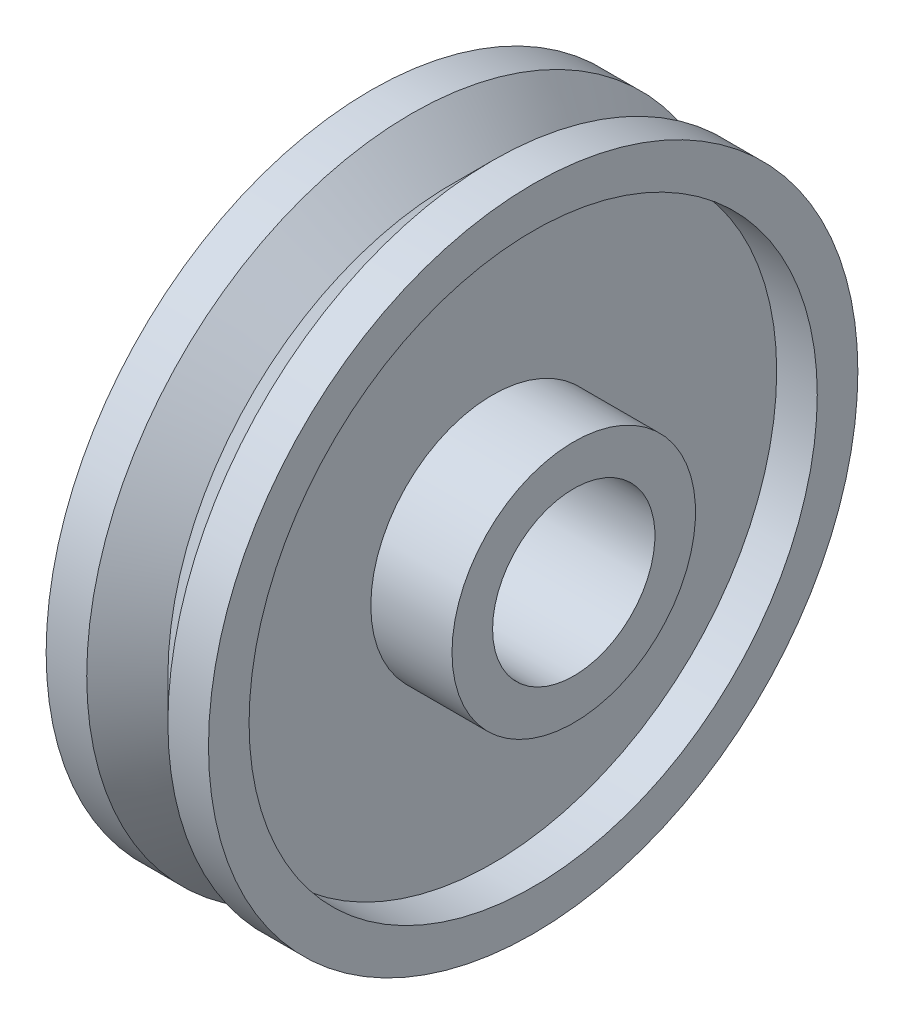
ISO-10303-21;
HEADER;
FILE_DESCRIPTION(('STEP AP214'),'2;1');
FILE_NAME('part.step','',(''),(''),'','','');
FILE_SCHEMA(('AUTOMOTIVE_DESIGN { 1 0 10303 214 1 1 1 1 }'));
ENDSEC;
DATA;
#1=APPLICATION_CONTEXT('core data for automotive mechanical design processes');
#2=APPLICATION_PROTOCOL_DEFINITION('international standard','automotive_design',2000,#1);
#3=PRODUCT_CONTEXT('',#1,'mechanical');
#4=PRODUCT('Part','Part','',(#3));
#5=PRODUCT_RELATED_PRODUCT_CATEGORY('part','',(#4));
#6=PRODUCT_DEFINITION_FORMATION('','',#4);
#7=PRODUCT_DEFINITION_CONTEXT('part definition',#1,'design');
#8=PRODUCT_DEFINITION('design','',#6,#7);
#9=PRODUCT_DEFINITION_SHAPE('','',#8);
#10=(LENGTH_UNIT() NAMED_UNIT(*) SI_UNIT(.MILLI.,.METRE.));
#11=(NAMED_UNIT(*) PLANE_ANGLE_UNIT() SI_UNIT($,.RADIAN.));
#12=(NAMED_UNIT(*) SI_UNIT($,.STERADIAN.) SOLID_ANGLE_UNIT());
#13=UNCERTAINTY_MEASURE_WITH_UNIT(LENGTH_MEASURE(1.E-05),#10,'distance_accuracy_value','');
#14=(GEOMETRIC_REPRESENTATION_CONTEXT(3) GLOBAL_UNCERTAINTY_ASSIGNED_CONTEXT((#13)) GLOBAL_UNIT_ASSIGNED_CONTEXT((#10,
#11,#12)) REPRESENTATION_CONTEXT('',''));
#15=CARTESIAN_POINT('',(0.,0.,0.));
#16=DIRECTION('',(0.,0.,1.));
#17=DIRECTION('',(1.,0.,0.));
#18=AXIS2_PLACEMENT_3D('',#15,#16,#17);
#19=CARTESIAN_POINT('',(19.05,12.7,0.));
#20=DIRECTION('',(-1.,0.,0.));
#21=DIRECTION('',(0.,0.,1.));
#22=AXIS2_PLACEMENT_3D('',#19,#20,#21);
#23=PLANE('',#22);
#24=CARTESIAN_POINT('',(19.05,0.,0.));
#25=DIRECTION('',(-1.,0.,0.));
#26=DIRECTION('',(0.,0.,1.));
#27=AXIS2_PLACEMENT_3D('',#24,#25,#26);
#28=CIRCLE('',#27,19.05);
#29=CARTESIAN_POINT('',(19.05,0.,19.05));
#30=VERTEX_POINT('',#29);
#31=EDGE_CURVE('E10',#30,#30,#28,.T.);
#32=ORIENTED_EDGE('',*,*,#31,.F.);
#33=EDGE_LOOP('',(#32));
#34=FACE_BOUND('',#33,.T.);
#35=CARTESIAN_POINT('',(19.05,0.,0.));
#36=DIRECTION('',(-1.,0.,0.));
#37=DIRECTION('',(0.,0.,1.));
#38=AXIS2_PLACEMENT_3D('',#35,#36,#37);
#39=CIRCLE('',#38,12.7);
#40=CARTESIAN_POINT('',(19.05,0.,12.7));
#41=VERTEX_POINT('',#40);
#42=EDGE_CURVE('E83',#41,#41,#39,.T.);
#43=ORIENTED_EDGE('',*,*,#42,.T.);
#44=EDGE_LOOP('',(#43));
#45=FACE_BOUND('',#44,.T.);
#46=ADVANCED_FACE('F34',(#34,#45),#23,.F.);
#47=CARTESIAN_POINT('',(-487.032527769321,0.,0.));
#48=DIRECTION('',(-1.,0.,0.));
#49=DIRECTION('',(0.,0.,1.));
#50=AXIS2_PLACEMENT_3D('',#47,#48,#49);
#51=CYLINDRICAL_SURFACE('',#50,19.05);
#52=CARTESIAN_POINT('',(6.35000000000002,0.,0.));
#53=DIRECTION('',(-1.,0.,0.));
#54=DIRECTION('',(0.,0.,1.));
#55=AXIS2_PLACEMENT_3D('',#52,#53,#54);
#56=CIRCLE('',#55,19.05);
#57=CARTESIAN_POINT('',(6.35000000000002,0.,19.05));
#58=VERTEX_POINT('',#57);
#59=EDGE_CURVE('E40',#58,#58,#56,.T.);
#60=ORIENTED_EDGE('',*,*,#59,.F.);
#61=EDGE_LOOP('',(#60));
#62=FACE_BOUND('',#61,.T.);
#63=ORIENTED_EDGE('',*,*,#31,.T.);
#64=EDGE_LOOP('',(#63));
#65=FACE_BOUND('',#64,.T.);
#66=ADVANCED_FACE('F162',(#62,#65),#51,.T.);
#67=CARTESIAN_POINT('',(6.35,19.05,0.));
#68=DIRECTION('',(-1.,0.,0.));
#69=DIRECTION('',(0.,0.,1.));
#70=AXIS2_PLACEMENT_3D('',#67,#68,#69);
#71=PLANE('',#70);
#72=CARTESIAN_POINT('',(6.35000000000002,0.,0.));
#73=DIRECTION('',(-1.,0.,0.));
#74=DIRECTION('',(0.,0.,1.));
#75=AXIS2_PLACEMENT_3D('',#72,#73,#74);
#76=CIRCLE('',#75,44.45);
#77=CARTESIAN_POINT('',(6.35000000000002,0.,44.45));
#78=VERTEX_POINT('',#77);
#79=EDGE_CURVE('E44',#78,#78,#76,.T.);
#80=ORIENTED_EDGE('',*,*,#79,.F.);
#81=EDGE_LOOP('',(#80));
#82=FACE_BOUND('',#81,.T.);
#83=ORIENTED_EDGE('',*,*,#59,.T.);
#84=EDGE_LOOP('',(#83));
#85=FACE_BOUND('',#84,.T.);
#86=ADVANCED_FACE('F157',(#82,#85),#71,.F.);
#87=CARTESIAN_POINT('',(-487.032527769321,0.,0.));
#88=DIRECTION('',(-1.,0.,0.));
#89=DIRECTION('',(0.,0.,1.));
#90=AXIS2_PLACEMENT_3D('',#87,#88,#89);
#91=CYLINDRICAL_SURFACE('',#90,44.45);
#92=CARTESIAN_POINT('',(12.7,0.,0.));
#93=DIRECTION('',(-1.,0.,0.));
#94=DIRECTION('',(0.,0.,1.));
#95=AXIS2_PLACEMENT_3D('',#92,#93,#94);
#96=CIRCLE('',#95,44.45);
#97=CARTESIAN_POINT('',(12.7,0.,44.45));
#98=VERTEX_POINT('',#97);
#99=EDGE_CURVE('E48',#98,#98,#96,.T.);
#100=ORIENTED_EDGE('',*,*,#99,.F.);
#101=EDGE_LOOP('',(#100));
#102=FACE_BOUND('',#101,.T.);
#103=ORIENTED_EDGE('',*,*,#79,.T.);
#104=EDGE_LOOP('',(#103));
#105=FACE_BOUND('',#104,.T.);
#106=ADVANCED_FACE('F151',(#102,#105),#91,.F.);
#107=CARTESIAN_POINT('',(12.7,44.45,0.));
#108=DIRECTION('',(-1.,0.,0.));
#109=DIRECTION('',(0.,0.,1.));
#110=AXIS2_PLACEMENT_3D('',#107,#108,#109);
#111=PLANE('',#110);
#112=CARTESIAN_POINT('',(12.7,0.,0.));
#113=DIRECTION('',(-1.,0.,0.));
#114=DIRECTION('',(0.,0.,1.));
#115=AXIS2_PLACEMENT_3D('',#112,#113,#114);
#116=CIRCLE('',#115,50.8);
#117=CARTESIAN_POINT('',(12.7,0.,50.8));
#118=VERTEX_POINT('',#117);
#119=EDGE_CURVE('E53',#118,#118,#116,.T.);
#120=ORIENTED_EDGE('',*,*,#119,.F.);
#121=EDGE_LOOP('',(#120));
#122=FACE_BOUND('',#121,.T.);
#123=ORIENTED_EDGE('',*,*,#99,.T.);
#124=EDGE_LOOP('',(#123));
#125=FACE_BOUND('',#124,.T.);
#126=ADVANCED_FACE('F145',(#122,#125),#111,.F.);
#127=CARTESIAN_POINT('',(-487.032527769321,0.,0.));
#128=DIRECTION('',(-1.,0.,0.));
#129=DIRECTION('',(0.,0.,1.));
#130=AXIS2_PLACEMENT_3D('',#127,#128,#129);
#131=CYLINDRICAL_SURFACE('',#130,50.8);
#132=CARTESIAN_POINT('',(6.34999999999991,0.,0.));
#133=DIRECTION('',(-1.,0.,0.));
#134=DIRECTION('',(0.,0.,1.));
#135=AXIS2_PLACEMENT_3D('',#132,#133,#134);
#136=CIRCLE('',#135,50.8);
#137=CARTESIAN_POINT('',(6.34999999999991,0.,50.8));
#138=VERTEX_POINT('',#137);
#139=EDGE_CURVE('E56',#138,#138,#136,.T.);
#140=ORIENTED_EDGE('',*,*,#139,.F.);
#141=EDGE_LOOP('',(#140));
#142=FACE_BOUND('',#141,.T.);
#143=ORIENTED_EDGE('',*,*,#119,.T.);
#144=EDGE_LOOP('',(#143));
#145=FACE_BOUND('',#144,.T.);
#146=ADVANCED_FACE('F139',(#142,#145),#131,.T.);
#147=CARTESIAN_POINT('',(6.34999999999991,0.,0.));
#148=DIRECTION('',(1.,0.,0.));
#149=DIRECTION('',(0.,0.,-1.));
#150=AXIS2_PLACEMENT_3D('',#147,#148,#149);
#151=CONICAL_SURFACE('',#150,50.8,0.785398163397455);
#152=CARTESIAN_POINT('',(0.,0.,0.));
#153=DIRECTION('',(-1.,0.,0.));
#154=DIRECTION('',(0.,0.,1.));
#155=AXIS2_PLACEMENT_3D('',#152,#153,#154);
#156=CIRCLE('',#155,44.45);
#157=CARTESIAN_POINT('',(0.,0.,44.45));
#158=VERTEX_POINT('',#157);
#159=EDGE_CURVE('E59',#158,#158,#156,.T.);
#160=ORIENTED_EDGE('',*,*,#159,.F.);
#161=EDGE_LOOP('',(#160));
#162=FACE_BOUND('',#161,.T.);
#163=ORIENTED_EDGE('',*,*,#139,.T.);
#164=EDGE_LOOP('',(#163));
#165=FACE_BOUND('',#164,.T.);
#166=ADVANCED_FACE('F133',(#162,#165),#151,.T.);
#167=CARTESIAN_POINT('',(0.,0.,0.));
#168=DIRECTION('',(-1.,0.,0.));
#169=DIRECTION('',(0.,0.,1.));
#170=AXIS2_PLACEMENT_3D('',#167,#168,#169);
#171=CONICAL_SURFACE('',#170,44.45,0.785398163397425);
#172=CARTESIAN_POINT('',(-6.3500000000003,0.,0.));
#173=DIRECTION('',(-1.,0.,0.));
#174=DIRECTION('',(0.,0.,1.));
#175=AXIS2_PLACEMENT_3D('',#172,#173,#174);
#176=CIRCLE('',#175,50.8);
#177=CARTESIAN_POINT('',(-6.3500000000003,0.,50.8));
#178=VERTEX_POINT('',#177);
#179=EDGE_CURVE('E62',#178,#178,#176,.T.);
#180=ORIENTED_EDGE('',*,*,#179,.F.);
#181=EDGE_LOOP('',(#180));
#182=FACE_BOUND('',#181,.T.);
#183=ORIENTED_EDGE('',*,*,#159,.T.);
#184=EDGE_LOOP('',(#183));
#185=FACE_BOUND('',#184,.T.);
#186=ADVANCED_FACE('F127',(#182,#185),#171,.T.);
#187=CARTESIAN_POINT('',(-487.032527769321,0.,0.));
#188=DIRECTION('',(-1.,0.,0.));
#189=DIRECTION('',(0.,0.,1.));
#190=AXIS2_PLACEMENT_3D('',#187,#188,#189);
#191=CYLINDRICAL_SURFACE('',#190,50.8);
#192=CARTESIAN_POINT('',(-12.7000000000003,0.,0.));
#193=DIRECTION('',(-1.,0.,0.));
#194=DIRECTION('',(0.,0.,1.));
#195=AXIS2_PLACEMENT_3D('',#192,#193,#194);
#196=CIRCLE('',#195,50.8);
#197=CARTESIAN_POINT('',(-12.7000000000003,0.,50.8));
#198=VERTEX_POINT('',#197);
#199=EDGE_CURVE('E65',#198,#198,#196,.T.);
#200=ORIENTED_EDGE('',*,*,#199,.F.);
#201=EDGE_LOOP('',(#200));
#202=FACE_BOUND('',#201,.T.);
#203=ORIENTED_EDGE('',*,*,#179,.T.);
#204=EDGE_LOOP('',(#203));
#205=FACE_BOUND('',#204,.T.);
#206=ADVANCED_FACE('F121',(#202,#205),#191,.T.);
#207=CARTESIAN_POINT('',(-12.7000000000003,44.45,0.));
#208=DIRECTION('',(1.,0.,0.));
#209=DIRECTION('',(0.,0.,-1.));
#210=AXIS2_PLACEMENT_3D('',#207,#208,#209);
#211=PLANE('',#210);
#212=CARTESIAN_POINT('',(-12.7000000000003,0.,0.));
#213=DIRECTION('',(-1.,0.,0.));
#214=DIRECTION('',(0.,0.,1.));
#215=AXIS2_PLACEMENT_3D('',#212,#213,#214);
#216=CIRCLE('',#215,44.45);
#217=CARTESIAN_POINT('',(-12.7000000000003,0.,44.45));
#218=VERTEX_POINT('',#217);
#219=EDGE_CURVE('E68',#218,#218,#216,.T.);
#220=ORIENTED_EDGE('',*,*,#219,.F.);
#221=EDGE_LOOP('',(#220));
#222=FACE_BOUND('',#221,.T.);
#223=ORIENTED_EDGE('',*,*,#199,.T.);
#224=EDGE_LOOP('',(#223));
#225=FACE_BOUND('',#224,.T.);
#226=ADVANCED_FACE('F115',(#222,#225),#211,.F.);
#227=CARTESIAN_POINT('',(-487.032527769321,0.,0.));
#228=DIRECTION('',(-1.,0.,0.));
#229=DIRECTION('',(0.,0.,1.));
#230=AXIS2_PLACEMENT_3D('',#227,#228,#229);
#231=CYLINDRICAL_SURFACE('',#230,44.45);
#232=CARTESIAN_POINT('',(-6.3500000000003,0.,0.));
#233=DIRECTION('',(-1.,0.,0.));
#234=DIRECTION('',(0.,0.,1.));
#235=AXIS2_PLACEMENT_3D('',#232,#233,#234);
#236=CIRCLE('',#235,44.45);
#237=CARTESIAN_POINT('',(-6.3500000000003,0.,44.45));
#238=VERTEX_POINT('',#237);
#239=EDGE_CURVE('E71',#238,#238,#236,.T.);
#240=ORIENTED_EDGE('',*,*,#239,.F.);
#241=EDGE_LOOP('',(#240));
#242=FACE_BOUND('',#241,.T.);
#243=ORIENTED_EDGE('',*,*,#219,.T.);
#244=EDGE_LOOP('',(#243));
#245=FACE_BOUND('',#244,.T.);
#246=ADVANCED_FACE('F109',(#242,#245),#231,.F.);
#247=CARTESIAN_POINT('',(-6.35000000000022,19.05,0.));
#248=DIRECTION('',(1.,0.,0.));
#249=DIRECTION('',(0.,0.,-1.));
#250=AXIS2_PLACEMENT_3D('',#247,#248,#249);
#251=PLANE('',#250);
#252=CARTESIAN_POINT('',(-6.35000000000013,0.,0.));
#253=DIRECTION('',(-1.,0.,0.));
#254=DIRECTION('',(0.,0.,1.));
#255=AXIS2_PLACEMENT_3D('',#252,#253,#254);
#256=CIRCLE('',#255,19.05);
#257=CARTESIAN_POINT('',(-6.35000000000013,0.,19.05));
#258=VERTEX_POINT('',#257);
#259=EDGE_CURVE('E74',#258,#258,#256,.T.);
#260=ORIENTED_EDGE('',*,*,#259,.F.);
#261=EDGE_LOOP('',(#260));
#262=FACE_BOUND('',#261,.T.);
#263=ORIENTED_EDGE('',*,*,#239,.T.);
#264=EDGE_LOOP('',(#263));
#265=FACE_BOUND('',#264,.T.);
#266=ADVANCED_FACE('F103',(#262,#265),#251,.F.);
#267=CARTESIAN_POINT('',(-487.032527769321,0.,0.));
#268=DIRECTION('',(-1.,0.,0.));
#269=DIRECTION('',(0.,0.,1.));
#270=AXIS2_PLACEMENT_3D('',#267,#268,#269);
#271=CYLINDRICAL_SURFACE('',#270,19.0499999999999);
#272=CARTESIAN_POINT('',(-19.0500000000001,0.,0.));
#273=DIRECTION('',(-1.,0.,0.));
#274=DIRECTION('',(0.,0.,1.));
#275=AXIS2_PLACEMENT_3D('',#272,#273,#274);
#276=CIRCLE('',#275,19.0499999999998);
#277=CARTESIAN_POINT('',(-19.0500000000001,0.,19.0499999999998));
#278=VERTEX_POINT('',#277);
#279=EDGE_CURVE('E77',#278,#278,#276,.T.);
#280=ORIENTED_EDGE('',*,*,#279,.F.);
#281=EDGE_LOOP('',(#280));
#282=FACE_BOUND('',#281,.T.);
#283=ORIENTED_EDGE('',*,*,#259,.T.);
#284=EDGE_LOOP('',(#283));
#285=FACE_BOUND('',#284,.T.);
#286=ADVANCED_FACE('F97',(#282,#285),#271,.T.);
#287=CARTESIAN_POINT('',(-19.0500000000001,12.6999999999999,0.));
#288=DIRECTION('',(1.,0.,0.));
#289=DIRECTION('',(0.,0.,-1.));
#290=AXIS2_PLACEMENT_3D('',#287,#288,#289);
#291=PLANE('',#290);
#292=CARTESIAN_POINT('',(-19.0500000000001,0.,0.));
#293=DIRECTION('',(-1.,0.,0.));
#294=DIRECTION('',(0.,0.,1.));
#295=AXIS2_PLACEMENT_3D('',#292,#293,#294);
#296=CIRCLE('',#295,12.6999999999999);
#297=CARTESIAN_POINT('',(-19.0500000000001,0.,12.6999999999999));
#298=VERTEX_POINT('',#297);
#299=EDGE_CURVE('E80',#298,#298,#296,.T.);
#300=ORIENTED_EDGE('',*,*,#299,.F.);
#301=EDGE_LOOP('',(#300));
#302=FACE_BOUND('',#301,.T.);
#303=ORIENTED_EDGE('',*,*,#279,.T.);
#304=EDGE_LOOP('',(#303));
#305=FACE_BOUND('',#304,.T.);
#306=ADVANCED_FACE('F91',(#302,#305),#291,.F.);
#307=CARTESIAN_POINT('',(-487.032527769321,0.,0.));
#308=DIRECTION('',(-1.,0.,0.));
#309=DIRECTION('',(0.,0.,1.));
#310=AXIS2_PLACEMENT_3D('',#307,#308,#309);
#311=CYLINDRICAL_SURFACE('',#310,12.6999999999999);
#312=ORIENTED_EDGE('',*,*,#42,.F.);
#313=EDGE_LOOP('',(#312));
#314=FACE_BOUND('',#313,.T.);
#315=ORIENTED_EDGE('',*,*,#299,.T.);
#316=EDGE_LOOP('',(#315));
#317=FACE_BOUND('',#316,.T.);
#318=ADVANCED_FACE('F88',(#314,#317),#311,.F.);
#319=CLOSED_SHELL('',(#46,#66,#86,#106,#126,#146,#166,#186,#206,#226,#246,#266,#286,#306,#318));
#320=MANIFOLD_SOLID_BREP('B2',#319);
#321=ADVANCED_BREP_SHAPE_REPRESENTATION('',(#18,#320),#14);
#322=SHAPE_DEFINITION_REPRESENTATION(#9,#321);
ENDSEC;
END-ISO-10303-21;
